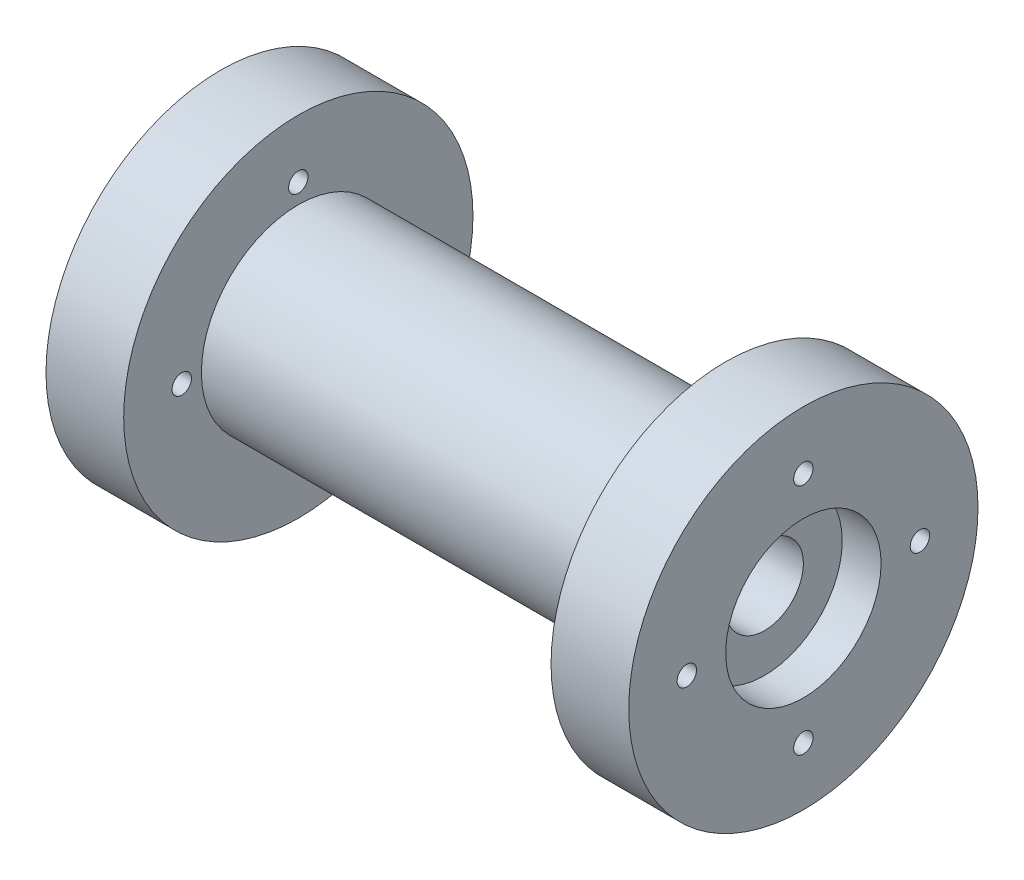
ISO-10303-21;
HEADER;
FILE_DESCRIPTION(('STEP AP214'),'2;1');
FILE_NAME('part.step','',(''),(''),'','','');
FILE_SCHEMA(('AUTOMOTIVE_DESIGN { 1 0 10303 214 1 1 1 1 }'));
ENDSEC;
DATA;
#1=APPLICATION_CONTEXT('core data for automotive mechanical design processes');
#2=APPLICATION_PROTOCOL_DEFINITION('international standard','automotive_design',2000,#1);
#3=PRODUCT_CONTEXT('',#1,'mechanical');
#4=PRODUCT('Part','Part','',(#3));
#5=PRODUCT_RELATED_PRODUCT_CATEGORY('part','',(#4));
#6=PRODUCT_DEFINITION_FORMATION('','',#4);
#7=PRODUCT_DEFINITION_CONTEXT('part definition',#1,'design');
#8=PRODUCT_DEFINITION('design','',#6,#7);
#9=PRODUCT_DEFINITION_SHAPE('','',#8);
#10=(LENGTH_UNIT() NAMED_UNIT(*) SI_UNIT(.MILLI.,.METRE.));
#11=(NAMED_UNIT(*) PLANE_ANGLE_UNIT() SI_UNIT($,.RADIAN.));
#12=(NAMED_UNIT(*) SI_UNIT($,.STERADIAN.) SOLID_ANGLE_UNIT());
#13=UNCERTAINTY_MEASURE_WITH_UNIT(LENGTH_MEASURE(1.E-05),#10,'distance_accuracy_value','');
#14=(GEOMETRIC_REPRESENTATION_CONTEXT(3) GLOBAL_UNCERTAINTY_ASSIGNED_CONTEXT((#13)) GLOBAL_UNIT_ASSIGNED_CONTEXT((#10,
#11,#12)) REPRESENTATION_CONTEXT('',''));
#15=CARTESIAN_POINT('',(0.,0.,0.));
#16=DIRECTION('',(0.,0.,1.));
#17=DIRECTION('',(1.,0.,0.));
#18=AXIS2_PLACEMENT_3D('',#15,#16,#17);
#19=CARTESIAN_POINT('',(0.,0.,0.));
#20=DIRECTION('',(-1.,0.,0.));
#21=DIRECTION('',(0.,0.,1.));
#22=AXIS2_PLACEMENT_3D('',#19,#20,#21);
#23=CYLINDRICAL_SURFACE('',#22,5.);
#24=CARTESIAN_POINT('',(5.,0.,0.));
#25=DIRECTION('',(-1.,0.,0.));
#26=DIRECTION('',(0.,0.,1.));
#27=AXIS2_PLACEMENT_3D('',#24,#25,#26);
#28=CIRCLE('',#27,5.);
#29=CARTESIAN_POINT('',(5.,0.,5.));
#30=VERTEX_POINT('',#29);
#31=EDGE_CURVE('E51',#30,#30,#28,.F.);
#32=ORIENTED_EDGE('',*,*,#31,.F.);
#33=EDGE_LOOP('',(#32));
#34=FACE_BOUND('',#33,.T.);
#35=CARTESIAN_POINT('',(70.,0.,0.));
#36=DIRECTION('',(1.,0.,0.));
#37=DIRECTION('',(0.,0.,-1.));
#38=AXIS2_PLACEMENT_3D('',#35,#36,#37);
#39=CIRCLE('',#38,5.);
#40=CARTESIAN_POINT('',(70.,0.,-5.));
#41=VERTEX_POINT('',#40);
#42=EDGE_CURVE('E39',#41,#41,#39,.F.);
#43=ORIENTED_EDGE('',*,*,#42,.F.);
#44=EDGE_LOOP('',(#43));
#45=FACE_BOUND('',#44,.T.);
#46=ADVANCED_FACE('F36',(#34,#45),#23,.F.);
#47=CARTESIAN_POINT('',(0.,5.,0.));
#48=DIRECTION('',(1.,0.,0.));
#49=DIRECTION('',(0.,0.,-1.));
#50=AXIS2_PLACEMENT_3D('',#47,#48,#49);
#51=PLANE('',#50);
#52=CARTESIAN_POINT('',(0.,0.,0.));
#53=DIRECTION('',(-1.,0.,0.));
#54=DIRECTION('',(0.,0.,1.));
#55=AXIS2_PLACEMENT_3D('',#52,#53,#54);
#56=CIRCLE('',#55,10.);
#57=CARTESIAN_POINT('',(0.,0.,10.));
#58=VERTEX_POINT('',#57);
#59=EDGE_CURVE('E61',#58,#58,#56,.T.);
#60=ORIENTED_EDGE('',*,*,#59,.F.);
#61=EDGE_LOOP('',(#60));
#62=FACE_BOUND('',#61,.T.);
#63=CARTESIAN_POINT('',(0.,15.,0.));
#64=DIRECTION('',(-1.,0.,0.));
#65=DIRECTION('',(0.,0.,1.));
#66=AXIS2_PLACEMENT_3D('',#63,#64,#65);
#67=CIRCLE('',#66,1.25);
#68=CARTESIAN_POINT('',(0.,15.,1.25));
#69=VERTEX_POINT('',#68);
#70=EDGE_CURVE('E75',#69,#69,#67,.T.);
#71=ORIENTED_EDGE('',*,*,#70,.F.);
#72=EDGE_LOOP('',(#71));
#73=FACE_BOUND('',#72,.T.);
#74=CARTESIAN_POINT('',(0.,0.,-15.));
#75=DIRECTION('',(-1.,0.,0.));
#76=DIRECTION('',(0.,0.,1.));
#77=AXIS2_PLACEMENT_3D('',#74,#75,#76);
#78=CIRCLE('',#77,1.25);
#79=CARTESIAN_POINT('',(0.,0.,-13.75));
#80=VERTEX_POINT('',#79);
#81=EDGE_CURVE('E78',#80,#80,#78,.T.);
#82=ORIENTED_EDGE('',*,*,#81,.F.);
#83=EDGE_LOOP('',(#82));
#84=FACE_BOUND('',#83,.T.);
#85=CARTESIAN_POINT('',(0.,-15.,0.));
#86=DIRECTION('',(-1.,0.,0.));
#87=DIRECTION('',(0.,0.,1.));
#88=AXIS2_PLACEMENT_3D('',#85,#86,#87);
#89=CIRCLE('',#88,1.25);
#90=CARTESIAN_POINT('',(0.,-15.,1.25));
#91=VERTEX_POINT('',#90);
#92=EDGE_CURVE('E84',#91,#91,#89,.T.);
#93=ORIENTED_EDGE('',*,*,#92,.F.);
#94=EDGE_LOOP('',(#93));
#95=FACE_BOUND('',#94,.T.);
#96=CARTESIAN_POINT('',(0.,0.,15.));
#97=DIRECTION('',(-1.,0.,0.));
#98=DIRECTION('',(0.,0.,1.));
#99=AXIS2_PLACEMENT_3D('',#96,#97,#98);
#100=CIRCLE('',#99,1.25);
#101=CARTESIAN_POINT('',(0.,0.,16.25));
#102=VERTEX_POINT('',#101);
#103=EDGE_CURVE('E58',#102,#102,#100,.T.);
#104=ORIENTED_EDGE('',*,*,#103,.F.);
#105=EDGE_LOOP('',(#104));
#106=FACE_BOUND('',#105,.T.);
#107=CARTESIAN_POINT('',(0.,0.,0.));
#108=DIRECTION('',(-1.,0.,0.));
#109=DIRECTION('',(0.,0.,1.));
#110=AXIS2_PLACEMENT_3D('',#107,#108,#109);
#111=CIRCLE('',#110,22.4736842105263);
#112=CARTESIAN_POINT('',(0.,0.,22.4736842105263));
#113=VERTEX_POINT('',#112);
#114=EDGE_CURVE('E10',#113,#113,#111,.T.);
#115=ORIENTED_EDGE('',*,*,#114,.T.);
#116=EDGE_LOOP('',(#115));
#117=FACE_BOUND('',#116,.T.);
#118=ADVANCED_FACE('F162',(#62,#73,#84,#95,#106,#117),#51,.F.);
#119=CARTESIAN_POINT('',(0.,0.,0.));
#120=DIRECTION('',(-1.,0.,0.));
#121=DIRECTION('',(0.,0.,1.));
#122=AXIS2_PLACEMENT_3D('',#119,#120,#121);
#123=CYLINDRICAL_SURFACE('',#122,22.4736842105263);
#124=ORIENTED_EDGE('',*,*,#114,.F.);
#125=EDGE_LOOP('',(#124));
#126=FACE_BOUND('',#125,.T.);
#127=CARTESIAN_POINT('',(10.,0.,0.));
#128=DIRECTION('',(-1.,0.,0.));
#129=DIRECTION('',(0.,0.,1.));
#130=AXIS2_PLACEMENT_3D('',#127,#128,#129);
#131=CIRCLE('',#130,22.4736842105263);
#132=CARTESIAN_POINT('',(10.,0.,22.4736842105263));
#133=VERTEX_POINT('',#132);
#134=EDGE_CURVE('E43',#133,#133,#131,.T.);
#135=ORIENTED_EDGE('',*,*,#134,.T.);
#136=EDGE_LOOP('',(#135));
#137=FACE_BOUND('',#136,.T.);
#138=ADVANCED_FACE('F167',(#126,#137),#123,.T.);
#139=CARTESIAN_POINT('',(10.,22.4736842105263,0.));
#140=DIRECTION('',(-1.,0.,0.));
#141=DIRECTION('',(0.,0.,1.));
#142=AXIS2_PLACEMENT_3D('',#139,#140,#141);
#143=PLANE('',#142);
#144=CARTESIAN_POINT('',(9.99999999999999,15.,0.));
#145=DIRECTION('',(-1.,0.,0.));
#146=DIRECTION('',(0.,0.,1.));
#147=AXIS2_PLACEMENT_3D('',#144,#145,#146);
#148=CIRCLE('',#147,1.25);
#149=CARTESIAN_POINT('',(9.99999999999999,15.,1.25));
#150=VERTEX_POINT('',#149);
#151=EDGE_CURVE('E112',#150,#150,#148,.T.);
#152=ORIENTED_EDGE('',*,*,#151,.T.);
#153=EDGE_LOOP('',(#152));
#154=FACE_BOUND('',#153,.T.);
#155=CARTESIAN_POINT('',(9.99999999999999,0.,-15.));
#156=DIRECTION('',(-1.,0.,0.));
#157=DIRECTION('',(0.,0.,1.));
#158=AXIS2_PLACEMENT_3D('',#155,#156,#157);
#159=CIRCLE('',#158,1.25);
#160=CARTESIAN_POINT('',(9.99999999999999,0.,-13.75));
#161=VERTEX_POINT('',#160);
#162=EDGE_CURVE('E106',#161,#161,#159,.T.);
#163=ORIENTED_EDGE('',*,*,#162,.T.);
#164=EDGE_LOOP('',(#163));
#165=FACE_BOUND('',#164,.T.);
#166=CARTESIAN_POINT('',(9.99999999999999,-15.,0.));
#167=DIRECTION('',(-1.,0.,0.));
#168=DIRECTION('',(0.,0.,1.));
#169=AXIS2_PLACEMENT_3D('',#166,#167,#168);
#170=CIRCLE('',#169,1.25);
#171=CARTESIAN_POINT('',(9.99999999999999,-15.,1.25));
#172=VERTEX_POINT('',#171);
#173=EDGE_CURVE('E100',#172,#172,#170,.T.);
#174=ORIENTED_EDGE('',*,*,#173,.T.);
#175=EDGE_LOOP('',(#174));
#176=FACE_BOUND('',#175,.T.);
#177=CARTESIAN_POINT('',(9.99999999999999,0.,15.));
#178=DIRECTION('',(-1.,0.,0.));
#179=DIRECTION('',(0.,0.,1.));
#180=AXIS2_PLACEMENT_3D('',#177,#178,#179);
#181=CIRCLE('',#180,1.25);
#182=CARTESIAN_POINT('',(9.99999999999999,0.,16.25));
#183=VERTEX_POINT('',#182);
#184=EDGE_CURVE('E94',#183,#183,#181,.T.);
#185=ORIENTED_EDGE('',*,*,#184,.T.);
#186=EDGE_LOOP('',(#185));
#187=FACE_BOUND('',#186,.T.);
#188=ORIENTED_EDGE('',*,*,#134,.F.);
#189=EDGE_LOOP('',(#188));
#190=FACE_BOUND('',#189,.T.);
#191=CARTESIAN_POINT('',(10.,0.,0.));
#192=DIRECTION('',(-1.,0.,0.));
#193=DIRECTION('',(0.,0.,1.));
#194=AXIS2_PLACEMENT_3D('',#191,#192,#193);
#195=CIRCLE('',#194,12.4736842105263);
#196=CARTESIAN_POINT('',(10.,0.,12.4736842105263));
#197=VERTEX_POINT('',#196);
#198=EDGE_CURVE('E48',#197,#197,#195,.T.);
#199=ORIENTED_EDGE('',*,*,#198,.T.);
#200=EDGE_LOOP('',(#199));
#201=FACE_BOUND('',#200,.T.);
#202=ADVANCED_FACE('F126',(#154,#165,#176,#187,#190,#201),#143,.F.);
#203=CARTESIAN_POINT('',(0.,0.,0.));
#204=DIRECTION('',(-1.,0.,0.));
#205=DIRECTION('',(0.,0.,1.));
#206=AXIS2_PLACEMENT_3D('',#203,#204,#205);
#207=CYLINDRICAL_SURFACE('',#206,12.4736842105263);
#208=ORIENTED_EDGE('',*,*,#198,.F.);
#209=EDGE_LOOP('',(#208));
#210=FACE_BOUND('',#209,.T.);
#211=CARTESIAN_POINT('',(65.,0.,0.));
#212=DIRECTION('',(-1.,0.,0.));
#213=DIRECTION('',(0.,0.,1.));
#214=AXIS2_PLACEMENT_3D('',#211,#212,#213);
#215=CIRCLE('',#214,12.4736842105263);
#216=CARTESIAN_POINT('',(65.,0.,12.4736842105263));
#217=VERTEX_POINT('',#216);
#218=EDGE_CURVE('E121',#217,#217,#215,.T.);
#219=ORIENTED_EDGE('',*,*,#218,.T.);
#220=EDGE_LOOP('',(#219));
#221=FACE_BOUND('',#220,.T.);
#222=ADVANCED_FACE('F128',(#210,#221),#207,.T.);
#223=CARTESIAN_POINT('',(65.,12.4736842105263,0.));
#224=DIRECTION('',(1.,0.,0.));
#225=DIRECTION('',(0.,0.,-1.));
#226=AXIS2_PLACEMENT_3D('',#223,#224,#225);
#227=PLANE('',#226);
#228=CARTESIAN_POINT('',(65.,15.,0.));
#229=DIRECTION('',(1.,0.,0.));
#230=DIRECTION('',(0.,0.,-1.));
#231=AXIS2_PLACEMENT_3D('',#228,#229,#230);
#232=CIRCLE('',#231,1.25);
#233=CARTESIAN_POINT('',(65.,15.,-1.25));
#234=VERTEX_POINT('',#233);
#235=EDGE_CURVE('E109',#234,#234,#232,.T.);
#236=ORIENTED_EDGE('',*,*,#235,.T.);
#237=EDGE_LOOP('',(#236));
#238=FACE_BOUND('',#237,.T.);
#239=CARTESIAN_POINT('',(65.,0.,-15.));
#240=DIRECTION('',(1.,0.,0.));
#241=DIRECTION('',(0.,0.,-1.));
#242=AXIS2_PLACEMENT_3D('',#239,#240,#241);
#243=CIRCLE('',#242,1.25);
#244=CARTESIAN_POINT('',(65.,0.,-16.25));
#245=VERTEX_POINT('',#244);
#246=EDGE_CURVE('E103',#245,#245,#243,.T.);
#247=ORIENTED_EDGE('',*,*,#246,.T.);
#248=EDGE_LOOP('',(#247));
#249=FACE_BOUND('',#248,.T.);
#250=CARTESIAN_POINT('',(65.,-15.,0.));
#251=DIRECTION('',(1.,0.,0.));
#252=DIRECTION('',(0.,0.,-1.));
#253=AXIS2_PLACEMENT_3D('',#250,#251,#252);
#254=CIRCLE('',#253,1.25);
#255=CARTESIAN_POINT('',(65.,-15.,-1.25));
#256=VERTEX_POINT('',#255);
#257=EDGE_CURVE('E97',#256,#256,#254,.T.);
#258=ORIENTED_EDGE('',*,*,#257,.T.);
#259=EDGE_LOOP('',(#258));
#260=FACE_BOUND('',#259,.T.);
#261=CARTESIAN_POINT('',(65.,0.,15.));
#262=DIRECTION('',(1.,0.,0.));
#263=DIRECTION('',(0.,0.,-1.));
#264=AXIS2_PLACEMENT_3D('',#261,#262,#263);
#265=CIRCLE('',#264,1.25);
#266=CARTESIAN_POINT('',(65.,0.,13.75));
#267=VERTEX_POINT('',#266);
#268=EDGE_CURVE('E74',#267,#267,#265,.T.);
#269=ORIENTED_EDGE('',*,*,#268,.T.);
#270=EDGE_LOOP('',(#269));
#271=FACE_BOUND('',#270,.T.);
#272=ORIENTED_EDGE('',*,*,#218,.F.);
#273=EDGE_LOOP('',(#272));
#274=FACE_BOUND('',#273,.T.);
#275=CARTESIAN_POINT('',(65.,0.,0.));
#276=DIRECTION('',(-1.,0.,0.));
#277=DIRECTION('',(0.,0.,1.));
#278=AXIS2_PLACEMENT_3D('',#275,#276,#277);
#279=CIRCLE('',#278,22.4736842105263);
#280=CARTESIAN_POINT('',(65.,0.,22.4736842105263));
#281=VERTEX_POINT('',#280);
#282=EDGE_CURVE('E118',#281,#281,#279,.T.);
#283=ORIENTED_EDGE('',*,*,#282,.T.);
#284=EDGE_LOOP('',(#283));
#285=FACE_BOUND('',#284,.T.);
#286=ADVANCED_FACE('F131',(#238,#249,#260,#271,#274,#285),#227,.F.);
#287=CARTESIAN_POINT('',(0.,0.,0.));
#288=DIRECTION('',(-1.,0.,0.));
#289=DIRECTION('',(0.,0.,1.));
#290=AXIS2_PLACEMENT_3D('',#287,#288,#289);
#291=CYLINDRICAL_SURFACE('',#290,22.4736842105263);
#292=ORIENTED_EDGE('',*,*,#282,.F.);
#293=EDGE_LOOP('',(#292));
#294=FACE_BOUND('',#293,.T.);
#295=CARTESIAN_POINT('',(75.,0.,0.));
#296=DIRECTION('',(-1.,0.,0.));
#297=DIRECTION('',(0.,0.,1.));
#298=AXIS2_PLACEMENT_3D('',#295,#296,#297);
#299=CIRCLE('',#298,22.4736842105263);
#300=CARTESIAN_POINT('',(75.,0.,22.4736842105263));
#301=VERTEX_POINT('',#300);
#302=EDGE_CURVE('E115',#301,#301,#299,.T.);
#303=ORIENTED_EDGE('',*,*,#302,.T.);
#304=EDGE_LOOP('',(#303));
#305=FACE_BOUND('',#304,.T.);
#306=ADVANCED_FACE('F137',(#294,#305),#291,.T.);
#307=CARTESIAN_POINT('',(75.,22.4736842105263,0.));
#308=DIRECTION('',(-1.,0.,0.));
#309=DIRECTION('',(0.,0.,1.));
#310=AXIS2_PLACEMENT_3D('',#307,#308,#309);
#311=PLANE('',#310);
#312=CARTESIAN_POINT('',(75.,0.,0.));
#313=DIRECTION('',(1.,0.,0.));
#314=DIRECTION('',(0.,0.,-1.));
#315=AXIS2_PLACEMENT_3D('',#312,#313,#314);
#316=CIRCLE('',#315,10.);
#317=CARTESIAN_POINT('',(75.,0.,-10.));
#318=VERTEX_POINT('',#317);
#319=EDGE_CURVE('E68',#318,#318,#316,.T.);
#320=ORIENTED_EDGE('',*,*,#319,.F.);
#321=EDGE_LOOP('',(#320));
#322=FACE_BOUND('',#321,.T.);
#323=CARTESIAN_POINT('',(75.,15.,0.));
#324=DIRECTION('',(-1.,0.,0.));
#325=DIRECTION('',(0.,0.,1.));
#326=AXIS2_PLACEMENT_3D('',#323,#324,#325);
#327=CIRCLE('',#326,1.25);
#328=CARTESIAN_POINT('',(75.,15.,1.25));
#329=VERTEX_POINT('',#328);
#330=EDGE_CURVE('E71',#329,#329,#327,.T.);
#331=ORIENTED_EDGE('',*,*,#330,.T.);
#332=EDGE_LOOP('',(#331));
#333=FACE_BOUND('',#332,.T.);
#334=CARTESIAN_POINT('',(75.,0.,-15.));
#335=DIRECTION('',(-1.,0.,0.));
#336=DIRECTION('',(0.,0.,1.));
#337=AXIS2_PLACEMENT_3D('',#334,#335,#336);
#338=CIRCLE('',#337,1.25);
#339=CARTESIAN_POINT('',(75.,0.,-13.75));
#340=VERTEX_POINT('',#339);
#341=EDGE_CURVE('E81',#340,#340,#338,.T.);
#342=ORIENTED_EDGE('',*,*,#341,.T.);
#343=EDGE_LOOP('',(#342));
#344=FACE_BOUND('',#343,.T.);
#345=CARTESIAN_POINT('',(75.,-15.,0.));
#346=DIRECTION('',(-1.,0.,0.));
#347=DIRECTION('',(0.,0.,1.));
#348=AXIS2_PLACEMENT_3D('',#345,#346,#347);
#349=CIRCLE('',#348,1.25);
#350=CARTESIAN_POINT('',(75.,-15.,1.25));
#351=VERTEX_POINT('',#350);
#352=EDGE_CURVE('E87',#351,#351,#349,.T.);
#353=ORIENTED_EDGE('',*,*,#352,.T.);
#354=EDGE_LOOP('',(#353));
#355=FACE_BOUND('',#354,.T.);
#356=CARTESIAN_POINT('',(75.,0.,15.));
#357=DIRECTION('',(-1.,0.,0.));
#358=DIRECTION('',(0.,0.,1.));
#359=AXIS2_PLACEMENT_3D('',#356,#357,#358);
#360=CIRCLE('',#359,1.25);
#361=CARTESIAN_POINT('',(75.,0.,16.25));
#362=VERTEX_POINT('',#361);
#363=EDGE_CURVE('E53',#362,#362,#360,.T.);
#364=ORIENTED_EDGE('',*,*,#363,.T.);
#365=EDGE_LOOP('',(#364));
#366=FACE_BOUND('',#365,.T.);
#367=ORIENTED_EDGE('',*,*,#302,.F.);
#368=EDGE_LOOP('',(#367));
#369=FACE_BOUND('',#368,.T.);
#370=ADVANCED_FACE('F144',(#322,#333,#344,#355,#366,#369),#311,.F.);
#371=CARTESIAN_POINT('',(75.,0.,15.));
#372=DIRECTION('',(-1.,0.,0.));
#373=DIRECTION('',(0.,0.,1.));
#374=AXIS2_PLACEMENT_3D('',#371,#372,#373);
#375=CYLINDRICAL_SURFACE('',#374,1.25);
#376=ORIENTED_EDGE('',*,*,#363,.F.);
#377=EDGE_LOOP('',(#376));
#378=FACE_BOUND('',#377,.T.);
#379=ORIENTED_EDGE('',*,*,#268,.F.);
#380=EDGE_LOOP('',(#379));
#381=FACE_BOUND('',#380,.T.);
#382=ADVANCED_FACE('F149',(#378,#381),#375,.F.);
#383=CARTESIAN_POINT('',(75.,-15.,0.));
#384=DIRECTION('',(-1.,0.,0.));
#385=DIRECTION('',(0.,0.,1.));
#386=AXIS2_PLACEMENT_3D('',#383,#384,#385);
#387=CYLINDRICAL_SURFACE('',#386,1.25);
#388=ORIENTED_EDGE('',*,*,#352,.F.);
#389=EDGE_LOOP('',(#388));
#390=FACE_BOUND('',#389,.T.);
#391=ORIENTED_EDGE('',*,*,#257,.F.);
#392=EDGE_LOOP('',(#391));
#393=FACE_BOUND('',#392,.T.);
#394=ADVANCED_FACE('F155',(#390,#393),#387,.F.);
#395=CARTESIAN_POINT('',(75.,0.,-15.));
#396=DIRECTION('',(-1.,0.,0.));
#397=DIRECTION('',(0.,0.,1.));
#398=AXIS2_PLACEMENT_3D('',#395,#396,#397);
#399=CYLINDRICAL_SURFACE('',#398,1.25);
#400=ORIENTED_EDGE('',*,*,#341,.F.);
#401=EDGE_LOOP('',(#400));
#402=FACE_BOUND('',#401,.T.);
#403=ORIENTED_EDGE('',*,*,#246,.F.);
#404=EDGE_LOOP('',(#403));
#405=FACE_BOUND('',#404,.T.);
#406=ADVANCED_FACE('F206',(#402,#405),#399,.F.);
#407=CARTESIAN_POINT('',(75.,15.,0.));
#408=DIRECTION('',(-1.,0.,0.));
#409=DIRECTION('',(0.,0.,1.));
#410=AXIS2_PLACEMENT_3D('',#407,#408,#409);
#411=CYLINDRICAL_SURFACE('',#410,1.25);
#412=ORIENTED_EDGE('',*,*,#330,.F.);
#413=EDGE_LOOP('',(#412));
#414=FACE_BOUND('',#413,.T.);
#415=ORIENTED_EDGE('',*,*,#235,.F.);
#416=EDGE_LOOP('',(#415));
#417=FACE_BOUND('',#416,.T.);
#418=ADVANCED_FACE('F201',(#414,#417),#411,.F.);
#419=ORIENTED_EDGE('',*,*,#103,.T.);
#420=EDGE_LOOP('',(#419));
#421=FACE_BOUND('',#420,.T.);
#422=ORIENTED_EDGE('',*,*,#184,.F.);
#423=EDGE_LOOP('',(#422));
#424=FACE_BOUND('',#423,.T.);
#425=ADVANCED_FACE('F158',(#421,#424),#375,.F.);
#426=ORIENTED_EDGE('',*,*,#92,.T.);
#427=EDGE_LOOP('',(#426));
#428=FACE_BOUND('',#427,.T.);
#429=ORIENTED_EDGE('',*,*,#173,.F.);
#430=EDGE_LOOP('',(#429));
#431=FACE_BOUND('',#430,.T.);
#432=ADVANCED_FACE('F204',(#428,#431),#387,.F.);
#433=ORIENTED_EDGE('',*,*,#81,.T.);
#434=EDGE_LOOP('',(#433));
#435=FACE_BOUND('',#434,.T.);
#436=ORIENTED_EDGE('',*,*,#162,.F.);
#437=EDGE_LOOP('',(#436));
#438=FACE_BOUND('',#437,.T.);
#439=ADVANCED_FACE('F199',(#435,#438),#399,.F.);
#440=ORIENTED_EDGE('',*,*,#70,.T.);
#441=EDGE_LOOP('',(#440));
#442=FACE_BOUND('',#441,.T.);
#443=ORIENTED_EDGE('',*,*,#151,.F.);
#444=EDGE_LOOP('',(#443));
#445=FACE_BOUND('',#444,.T.);
#446=ADVANCED_FACE('F193',(#442,#445),#411,.F.);
#447=CARTESIAN_POINT('',(5.,0.,0.));
#448=DIRECTION('',(-1.,0.,0.));
#449=DIRECTION('',(0.,0.,1.));
#450=AXIS2_PLACEMENT_3D('',#447,#448,#449);
#451=PLANE('',#450);
#452=CARTESIAN_POINT('',(5.,0.,0.));
#453=DIRECTION('',(-1.,0.,0.));
#454=DIRECTION('',(0.,0.,1.));
#455=AXIS2_PLACEMENT_3D('',#452,#453,#454);
#456=CIRCLE('',#455,10.);
#457=CARTESIAN_POINT('',(5.,0.,10.));
#458=VERTEX_POINT('',#457);
#459=EDGE_CURVE('E54',#458,#458,#456,.T.);
#460=ORIENTED_EDGE('',*,*,#459,.T.);
#461=EDGE_LOOP('',(#460));
#462=FACE_BOUND('',#461,.T.);
#463=ORIENTED_EDGE('',*,*,#31,.T.);
#464=EDGE_LOOP('',(#463));
#465=FACE_BOUND('',#464,.T.);
#466=ADVANCED_FACE('F190',(#462,#465),#451,.T.);
#467=CARTESIAN_POINT('',(5.,0.,0.));
#468=DIRECTION('',(-1.,0.,0.));
#469=DIRECTION('',(0.,0.,1.));
#470=AXIS2_PLACEMENT_3D('',#467,#468,#469);
#471=CYLINDRICAL_SURFACE('',#470,10.);
#472=ORIENTED_EDGE('',*,*,#459,.F.);
#473=EDGE_LOOP('',(#472));
#474=FACE_BOUND('',#473,.T.);
#475=ORIENTED_EDGE('',*,*,#59,.T.);
#476=EDGE_LOOP('',(#475));
#477=FACE_BOUND('',#476,.T.);
#478=ADVANCED_FACE('F187',(#474,#477),#471,.F.);
#479=CARTESIAN_POINT('',(70.,0.,0.));
#480=DIRECTION('',(1.,0.,0.));
#481=DIRECTION('',(0.,0.,-1.));
#482=AXIS2_PLACEMENT_3D('',#479,#480,#481);
#483=PLANE('',#482);
#484=CARTESIAN_POINT('',(70.,0.,0.));
#485=DIRECTION('',(1.,0.,0.));
#486=DIRECTION('',(0.,0.,-1.));
#487=AXIS2_PLACEMENT_3D('',#484,#485,#486);
#488=CIRCLE('',#487,10.);
#489=CARTESIAN_POINT('',(70.,0.,-10.));
#490=VERTEX_POINT('',#489);
#491=EDGE_CURVE('E173',#490,#490,#488,.T.);
#492=ORIENTED_EDGE('',*,*,#491,.T.);
#493=EDGE_LOOP('',(#492));
#494=FACE_BOUND('',#493,.T.);
#495=ORIENTED_EDGE('',*,*,#42,.T.);
#496=EDGE_LOOP('',(#495));
#497=FACE_BOUND('',#496,.T.);
#498=ADVANCED_FACE('F181',(#494,#497),#483,.T.);
#499=CARTESIAN_POINT('',(70.,0.,0.));
#500=DIRECTION('',(1.,0.,0.));
#501=DIRECTION('',(0.,0.,-1.));
#502=AXIS2_PLACEMENT_3D('',#499,#500,#501);
#503=CYLINDRICAL_SURFACE('',#502,10.);
#504=ORIENTED_EDGE('',*,*,#491,.F.);
#505=EDGE_LOOP('',(#504));
#506=FACE_BOUND('',#505,.T.);
#507=ORIENTED_EDGE('',*,*,#319,.T.);
#508=EDGE_LOOP('',(#507));
#509=FACE_BOUND('',#508,.T.);
#510=ADVANCED_FACE('F179',(#506,#509),#503,.F.);
#511=CLOSED_SHELL('',(#46,#118,#138,#202,#222,#286,#306,#370,#382,#394,#406,#418,#425,#432,#439,
#446,#466,#478,#498,#510));
#512=MANIFOLD_SOLID_BREP('B2',#511);
#513=ADVANCED_BREP_SHAPE_REPRESENTATION('',(#18,#512),#14);
#514=SHAPE_DEFINITION_REPRESENTATION(#9,#513);
ENDSEC;
END-ISO-10303-21;
